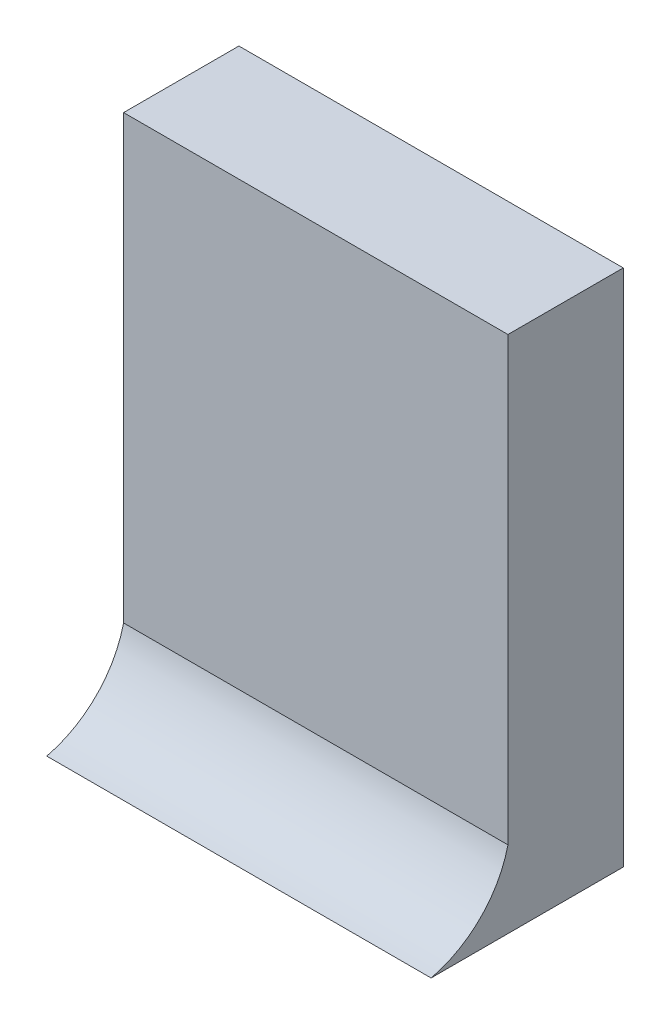
ISO-10303-21;
HEADER;
FILE_DESCRIPTION(('STEP AP214'),'2;1');
FILE_NAME('part.step','',(''),(''),'','','');
FILE_SCHEMA(('AUTOMOTIVE_DESIGN { 1 0 10303 214 1 1 1 1 }'));
ENDSEC;
DATA;
#1=APPLICATION_CONTEXT('core data for automotive mechanical design processes');
#2=APPLICATION_PROTOCOL_DEFINITION('international standard','automotive_design',2000,#1);
#3=PRODUCT_CONTEXT('',#1,'mechanical');
#4=PRODUCT('Part','Part','',(#3));
#5=PRODUCT_RELATED_PRODUCT_CATEGORY('part','',(#4));
#6=PRODUCT_DEFINITION_FORMATION('','',#4);
#7=PRODUCT_DEFINITION_CONTEXT('part definition',#1,'design');
#8=PRODUCT_DEFINITION('design','',#6,#7);
#9=PRODUCT_DEFINITION_SHAPE('','',#8);
#10=(LENGTH_UNIT() NAMED_UNIT(*) SI_UNIT(.MILLI.,.METRE.));
#11=(NAMED_UNIT(*) PLANE_ANGLE_UNIT() SI_UNIT($,.RADIAN.));
#12=(NAMED_UNIT(*) SI_UNIT($,.STERADIAN.) SOLID_ANGLE_UNIT());
#13=UNCERTAINTY_MEASURE_WITH_UNIT(LENGTH_MEASURE(1.E-05),#10,'distance_accuracy_value','');
#14=(GEOMETRIC_REPRESENTATION_CONTEXT(3) GLOBAL_UNCERTAINTY_ASSIGNED_CONTEXT((#13)) GLOBAL_UNIT_ASSIGNED_CONTEXT((#10,
#11,#12)) REPRESENTATION_CONTEXT('',''));
#15=CARTESIAN_POINT('',(0.,0.,0.));
#16=DIRECTION('',(0.,0.,1.));
#17=DIRECTION('',(1.,0.,0.));
#18=AXIS2_PLACEMENT_3D('',#15,#16,#17);
#19=CARTESIAN_POINT('',(0.,0.,15.));
#20=DIRECTION('',(0.,0.,1.));
#21=DIRECTION('',(1.,0.,0.));
#22=AXIS2_PLACEMENT_3D('',#19,#20,#21);
#23=PLANE('',#22);
#24=DIRECTION('',(0.,-1.,0.));
#25=VECTOR('',#24,1.);
#26=CARTESIAN_POINT('',(-25.,33.75,15.));
#27=LINE('',#26,#25);
#28=CARTESIAN_POINT('',(-25.,33.75,15.));
#29=VERTEX_POINT('',#28);
#30=CARTESIAN_POINT('',(-25.,-23.75,15.));
#31=VERTEX_POINT('',#30);
#32=EDGE_CURVE('E105',#29,#31,#27,.T.);
#33=ORIENTED_EDGE('',*,*,#32,.T.);
#34=DIRECTION('',(1.,0.,0.));
#35=VECTOR('',#34,1.);
#36=CARTESIAN_POINT('',(-39.1421356237309,-23.75,15.));
#37=LINE('',#36,#35);
#38=CARTESIAN_POINT('',(25.,-23.75,15.));
#39=VERTEX_POINT('',#38);
#40=EDGE_CURVE('E135',#31,#39,#37,.T.);
#41=ORIENTED_EDGE('',*,*,#40,.T.);
#42=DIRECTION('',(0.,1.,0.));
#43=VECTOR('',#42,1.);
#44=CARTESIAN_POINT('',(25.,33.75,15.));
#45=LINE('',#44,#43);
#46=CARTESIAN_POINT('',(25.,33.75,15.));
#47=VERTEX_POINT('',#46);
#48=EDGE_CURVE('E96',#39,#47,#45,.T.);
#49=ORIENTED_EDGE('',*,*,#48,.T.);
#50=DIRECTION('',(-1.,0.,0.));
#51=VECTOR('',#50,1.);
#52=CARTESIAN_POINT('',(-25.,33.75,15.));
#53=LINE('',#52,#51);
#54=EDGE_CURVE('E64',#47,#29,#53,.T.);
#55=ORIENTED_EDGE('',*,*,#54,.T.);
#56=EDGE_LOOP('',(#33,#41,#49,#55));
#57=FACE_BOUND('',#56,.T.);
#58=ADVANCED_FACE('F39',(#57),#23,.T.);
#59=CARTESIAN_POINT('',(25.,33.75,15.));
#60=DIRECTION('',(-1.,0.,0.));
#61=DIRECTION('',(0.,-1.,0.));
#62=AXIS2_PLACEMENT_3D('',#59,#60,#61);
#63=PLANE('',#62);
#64=DIRECTION('',(0.,1.,0.));
#65=VECTOR('',#64,1.);
#66=CARTESIAN_POINT('',(25.,33.75,0.));
#67=LINE('',#66,#65);
#68=CARTESIAN_POINT('',(25.,-33.75,0.));
#69=VERTEX_POINT('',#68);
#70=CARTESIAN_POINT('',(25.,33.75,0.));
#71=VERTEX_POINT('',#70);
#72=EDGE_CURVE('E102',#69,#71,#67,.T.);
#73=ORIENTED_EDGE('',*,*,#72,.T.);
#74=DIRECTION('',(0.,0.,-1.));
#75=VECTOR('',#74,1.);
#76=CARTESIAN_POINT('',(25.,33.75,15.));
#77=LINE('',#76,#75);
#78=EDGE_CURVE('E11',#47,#71,#77,.T.);
#79=ORIENTED_EDGE('',*,*,#78,.F.);
#80=ORIENTED_EDGE('',*,*,#48,.F.);
#81=CARTESIAN_POINT('',(25.,-20.6844501148095,28.0655498851905));
#82=DIRECTION('',(-1.,0.,0.));
#83=DIRECTION('',(0.,-1.,0.));
#84=AXIS2_PLACEMENT_3D('',#81,#82,#83);
#85=CIRCLE('',#84,13.4203647454529);
#86=CARTESIAN_POINT('',(25.,-33.75,25.));
#87=VERTEX_POINT('',#86);
#88=EDGE_CURVE('E55',#39,#87,#85,.T.);
#89=ORIENTED_EDGE('',*,*,#88,.T.);
#90=DIRECTION('',(0.,0.,-1.));
#91=VECTOR('',#90,1.);
#92=CARTESIAN_POINT('',(25.,-33.75,15.));
#93=LINE('',#92,#91);
#94=EDGE_CURVE('E89',#87,#69,#93,.T.);
#95=ORIENTED_EDGE('',*,*,#94,.T.);
#96=EDGE_LOOP('',(#73,#79,#80,#89,#95));
#97=FACE_BOUND('',#96,.T.);
#98=ADVANCED_FACE('F41',(#97),#63,.F.);
#99=CARTESIAN_POINT('',(-25.,33.75,15.));
#100=DIRECTION('',(0.,-1.,0.));
#101=DIRECTION('',(1.,0.,0.));
#102=AXIS2_PLACEMENT_3D('',#99,#100,#101);
#103=PLANE('',#102);
#104=DIRECTION('',(-1.,0.,0.));
#105=VECTOR('',#104,1.);
#106=CARTESIAN_POINT('',(-25.,33.75,0.));
#107=LINE('',#106,#105);
#108=CARTESIAN_POINT('',(-25.,33.75,0.));
#109=VERTEX_POINT('',#108);
#110=EDGE_CURVE('E108',#71,#109,#107,.T.);
#111=ORIENTED_EDGE('',*,*,#110,.T.);
#112=DIRECTION('',(0.,0.,-1.));
#113=VECTOR('',#112,1.);
#114=CARTESIAN_POINT('',(-25.,33.75,15.));
#115=LINE('',#114,#113);
#116=EDGE_CURVE('E48',#29,#109,#115,.T.);
#117=ORIENTED_EDGE('',*,*,#116,.F.);
#118=ORIENTED_EDGE('',*,*,#54,.F.);
#119=ORIENTED_EDGE('',*,*,#78,.T.);
#120=EDGE_LOOP('',(#111,#117,#118,#119));
#121=FACE_BOUND('',#120,.T.);
#122=ADVANCED_FACE('F130',(#121),#103,.F.);
#123=CARTESIAN_POINT('',(-25.,33.75,15.));
#124=DIRECTION('',(1.,0.,0.));
#125=DIRECTION('',(0.,1.,0.));
#126=AXIS2_PLACEMENT_3D('',#123,#124,#125);
#127=PLANE('',#126);
#128=DIRECTION('',(0.,-1.,0.));
#129=VECTOR('',#128,1.);
#130=CARTESIAN_POINT('',(-25.,33.75,0.));
#131=LINE('',#130,#129);
#132=CARTESIAN_POINT('',(-25.,-33.75,0.));
#133=VERTEX_POINT('',#132);
#134=EDGE_CURVE('E97',#109,#133,#131,.T.);
#135=ORIENTED_EDGE('',*,*,#134,.T.);
#136=DIRECTION('',(0.,0.,-1.));
#137=VECTOR('',#136,1.);
#138=CARTESIAN_POINT('',(-25.,-33.75,15.));
#139=LINE('',#138,#137);
#140=CARTESIAN_POINT('',(-25.,-33.75,25.));
#141=VERTEX_POINT('',#140);
#142=EDGE_CURVE('E91',#141,#133,#139,.T.);
#143=ORIENTED_EDGE('',*,*,#142,.F.);
#144=CARTESIAN_POINT('',(-25.,-20.6844501148095,28.0655498851905));
#145=DIRECTION('',(1.,0.,0.));
#146=DIRECTION('',(0.,1.,0.));
#147=AXIS2_PLACEMENT_3D('',#144,#145,#146);
#148=CIRCLE('',#147,13.4203647454529);
#149=EDGE_CURVE('E110',#141,#31,#148,.T.);
#150=ORIENTED_EDGE('',*,*,#149,.T.);
#151=ORIENTED_EDGE('',*,*,#32,.F.);
#152=ORIENTED_EDGE('',*,*,#116,.T.);
#153=EDGE_LOOP('',(#135,#143,#150,#151,#152));
#154=FACE_BOUND('',#153,.T.);
#155=ADVANCED_FACE('F128',(#154),#127,.F.);
#156=CARTESIAN_POINT('',(-25.,-33.75,15.));
#157=DIRECTION('',(0.,1.,0.));
#158=DIRECTION('',(0.,0.,1.));
#159=AXIS2_PLACEMENT_3D('',#156,#157,#158);
#160=PLANE('',#159);
#161=DIRECTION('',(1.,0.,0.));
#162=VECTOR('',#161,1.);
#163=CARTESIAN_POINT('',(-25.,-33.75,0.));
#164=LINE('',#163,#162);
#165=EDGE_CURVE('E84',#133,#69,#164,.T.);
#166=ORIENTED_EDGE('',*,*,#165,.T.);
#167=ORIENTED_EDGE('',*,*,#94,.F.);
#168=DIRECTION('',(1.,0.,0.));
#169=VECTOR('',#168,1.);
#170=CARTESIAN_POINT('',(-39.1421356237309,-33.75,25.));
#171=LINE('',#170,#169);
#172=EDGE_CURVE('E116',#141,#87,#171,.T.);
#173=ORIENTED_EDGE('',*,*,#172,.F.);
#174=ORIENTED_EDGE('',*,*,#142,.T.);
#175=EDGE_LOOP('',(#166,#167,#173,#174));
#176=FACE_BOUND('',#175,.T.);
#177=ADVANCED_FACE('F86',(#176),#160,.F.);
#178=CARTESIAN_POINT('',(0.,0.,0.));
#179=DIRECTION('',(0.,0.,1.));
#180=DIRECTION('',(1.,0.,0.));
#181=AXIS2_PLACEMENT_3D('',#178,#179,#180);
#182=PLANE('',#181);
#183=ORIENTED_EDGE('',*,*,#72,.F.);
#184=ORIENTED_EDGE('',*,*,#165,.F.);
#185=ORIENTED_EDGE('',*,*,#134,.F.);
#186=ORIENTED_EDGE('',*,*,#110,.F.);
#187=EDGE_LOOP('',(#183,#184,#185,#186));
#188=FACE_BOUND('',#187,.T.);
#189=ADVANCED_FACE('F107',(#188),#182,.F.);
#190=CARTESIAN_POINT('',(-39.1421356237309,-20.6844501148095,28.0655498851905));
#191=DIRECTION('',(1.,0.,0.));
#192=DIRECTION('',(0.,1.,0.));
#193=AXIS2_PLACEMENT_3D('',#190,#191,#192);
#194=CYLINDRICAL_SURFACE('',#193,13.4203647454529);
#195=ORIENTED_EDGE('',*,*,#149,.F.);
#196=ORIENTED_EDGE('',*,*,#172,.T.);
#197=ORIENTED_EDGE('',*,*,#88,.F.);
#198=ORIENTED_EDGE('',*,*,#40,.F.);
#199=EDGE_LOOP('',(#195,#196,#197,#198));
#200=FACE_BOUND('',#199,.T.);
#201=ADVANCED_FACE('F142',(#200),#194,.F.);
#202=CLOSED_SHELL('',(#58,#98,#122,#155,#177,#189,#201));
#203=MANIFOLD_SOLID_BREP('B2',#202);
#204=ADVANCED_BREP_SHAPE_REPRESENTATION('',(#18,#203),#14);
#205=SHAPE_DEFINITION_REPRESENTATION(#9,#204);
ENDSEC;
END-ISO-10303-21;
